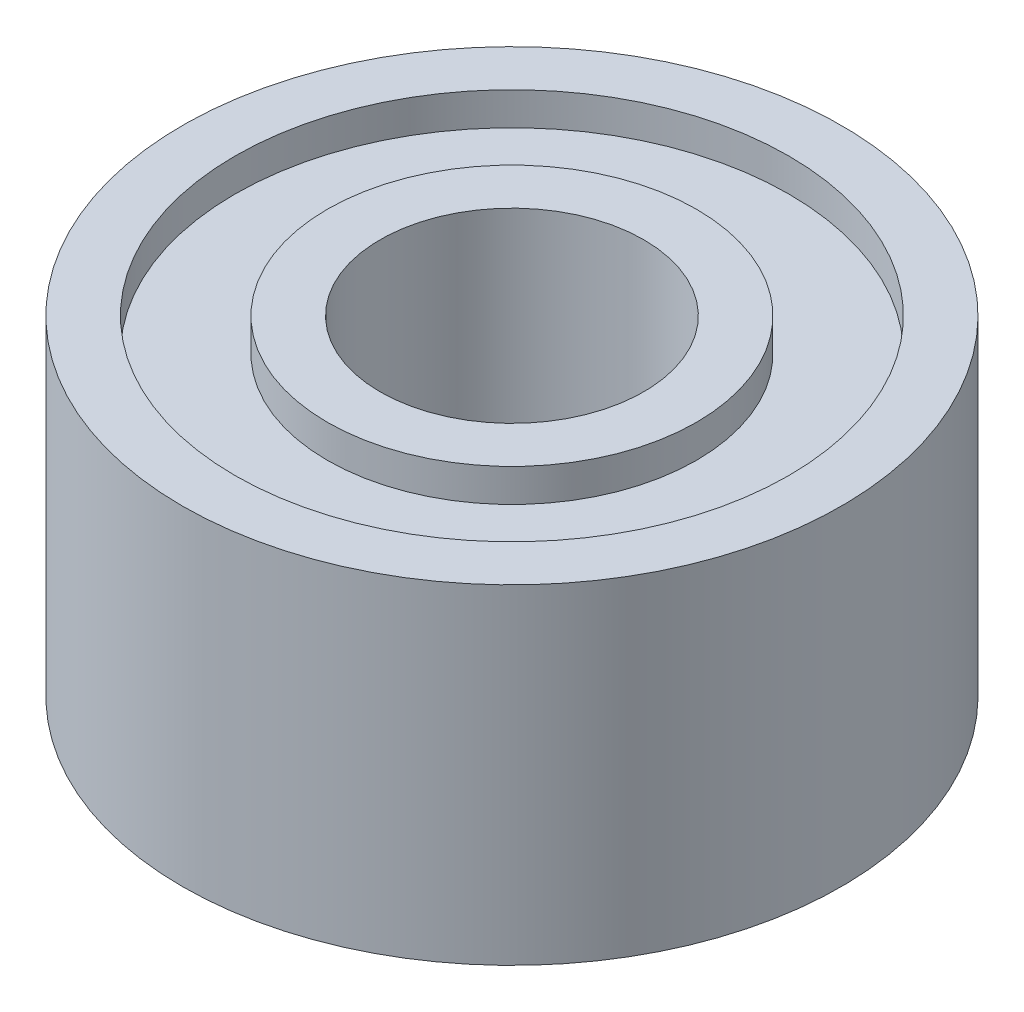
ISO-10303-21;
HEADER;
FILE_DESCRIPTION(('STEP AP214'),'2;1');
FILE_NAME('part.step','',(''),(''),'','','');
FILE_SCHEMA(('AUTOMOTIVE_DESIGN { 1 0 10303 214 1 1 1 1 }'));
ENDSEC;
DATA;
#1=APPLICATION_CONTEXT('core data for automotive mechanical design processes');
#2=APPLICATION_PROTOCOL_DEFINITION('international standard','automotive_design',2000,#1);
#3=PRODUCT_CONTEXT('',#1,'mechanical');
#4=PRODUCT('Part','Part','',(#3));
#5=PRODUCT_RELATED_PRODUCT_CATEGORY('part','',(#4));
#6=PRODUCT_DEFINITION_FORMATION('','',#4);
#7=PRODUCT_DEFINITION_CONTEXT('part definition',#1,'design');
#8=PRODUCT_DEFINITION('design','',#6,#7);
#9=PRODUCT_DEFINITION_SHAPE('','',#8);
#10=(LENGTH_UNIT() NAMED_UNIT(*) SI_UNIT(.MILLI.,.METRE.));
#11=(NAMED_UNIT(*) PLANE_ANGLE_UNIT() SI_UNIT($,.RADIAN.));
#12=(NAMED_UNIT(*) SI_UNIT($,.STERADIAN.) SOLID_ANGLE_UNIT());
#13=UNCERTAINTY_MEASURE_WITH_UNIT(LENGTH_MEASURE(1.E-05),#10,'distance_accuracy_value','');
#14=(GEOMETRIC_REPRESENTATION_CONTEXT(3) GLOBAL_UNCERTAINTY_ASSIGNED_CONTEXT((#13)) GLOBAL_UNIT_ASSIGNED_CONTEXT((#10,
#11,#12)) REPRESENTATION_CONTEXT('',''));
#15=CARTESIAN_POINT('',(0.,0.,0.));
#16=DIRECTION('',(0.,0.,1.));
#17=DIRECTION('',(1.,0.,0.));
#18=AXIS2_PLACEMENT_3D('',#15,#16,#17);
#19=CARTESIAN_POINT('',(0.,-1.25,0.));
#20=DIRECTION('',(0.,1.,0.));
#21=DIRECTION('',(0.,0.,1.));
#22=AXIS2_PLACEMENT_3D('',#19,#20,#21);
#23=PLANE('',#22);
#24=CARTESIAN_POINT('',(0.,-1.25,0.));
#25=DIRECTION('',(0.,1.,0.));
#26=DIRECTION('',(0.,0.,1.));
#27=AXIS2_PLACEMENT_3D('',#24,#25,#26);
#28=CIRCLE('',#27,1.);
#29=CARTESIAN_POINT('',(0.,-1.25,1.));
#30=VERTEX_POINT('',#29);
#31=EDGE_CURVE('E46',#30,#30,#28,.T.);
#32=ORIENTED_EDGE('',*,*,#31,.T.);
#33=EDGE_LOOP('',(#32));
#34=FACE_BOUND('',#33,.T.);
#35=CARTESIAN_POINT('',(0.,-1.25,0.));
#36=DIRECTION('',(0.,1.,0.));
#37=DIRECTION('',(0.,0.,1.));
#38=AXIS2_PLACEMENT_3D('',#35,#36,#37);
#39=CIRCLE('',#38,1.4);
#40=CARTESIAN_POINT('',(0.,-1.25,1.4));
#41=VERTEX_POINT('',#40);
#42=EDGE_CURVE('E70',#41,#41,#39,.T.);
#43=ORIENTED_EDGE('',*,*,#42,.F.);
#44=EDGE_LOOP('',(#43));
#45=FACE_BOUND('',#44,.T.);
#46=ADVANCED_FACE('F33',(#34,#45),#23,.F.);
#47=CARTESIAN_POINT('',(0.,1.25,0.));
#48=DIRECTION('',(0.,1.,0.));
#49=DIRECTION('',(0.,0.,1.));
#50=AXIS2_PLACEMENT_3D('',#47,#48,#49);
#51=PLANE('',#50);
#52=CARTESIAN_POINT('',(0.,1.25,0.));
#53=DIRECTION('',(0.,1.,0.));
#54=DIRECTION('',(0.,0.,1.));
#55=AXIS2_PLACEMENT_3D('',#52,#53,#54);
#56=CIRCLE('',#55,1.);
#57=CARTESIAN_POINT('',(0.,1.25,1.));
#58=VERTEX_POINT('',#57);
#59=EDGE_CURVE('E44',#58,#58,#56,.T.);
#60=ORIENTED_EDGE('',*,*,#59,.F.);
#61=EDGE_LOOP('',(#60));
#62=FACE_BOUND('',#61,.T.);
#63=CARTESIAN_POINT('',(0.,1.25,0.));
#64=DIRECTION('',(0.,1.,0.));
#65=DIRECTION('',(0.,0.,1.));
#66=AXIS2_PLACEMENT_3D('',#63,#64,#65);
#67=CIRCLE('',#66,1.4);
#68=CARTESIAN_POINT('',(0.,1.25,1.4));
#69=VERTEX_POINT('',#68);
#70=EDGE_CURVE('E58',#69,#69,#67,.T.);
#71=ORIENTED_EDGE('',*,*,#70,.T.);
#72=EDGE_LOOP('',(#71));
#73=FACE_BOUND('',#72,.T.);
#74=ADVANCED_FACE('F86',(#62,#73),#51,.T.);
#75=CARTESIAN_POINT('',(0.,1.25,0.));
#76=DIRECTION('',(0.,1.,0.));
#77=DIRECTION('',(0.,0.,1.));
#78=AXIS2_PLACEMENT_3D('',#75,#76,#77);
#79=CIRCLE('',#78,2.1);
#80=CARTESIAN_POINT('',(0.,1.25,2.1));
#81=VERTEX_POINT('',#80);
#82=EDGE_CURVE('E52',#81,#81,#79,.T.);
#83=ORIENTED_EDGE('',*,*,#82,.F.);
#84=EDGE_LOOP('',(#83));
#85=FACE_BOUND('',#84,.T.);
#86=CARTESIAN_POINT('',(0.,1.25,0.));
#87=DIRECTION('',(0.,1.,0.));
#88=DIRECTION('',(0.,0.,1.));
#89=AXIS2_PLACEMENT_3D('',#86,#87,#88);
#90=CIRCLE('',#89,2.5);
#91=CARTESIAN_POINT('',(0.,1.25,2.5));
#92=VERTEX_POINT('',#91);
#93=EDGE_CURVE('E10',#92,#92,#90,.T.);
#94=ORIENTED_EDGE('',*,*,#93,.T.);
#95=EDGE_LOOP('',(#94));
#96=FACE_BOUND('',#95,.T.);
#97=ADVANCED_FACE('F92',(#85,#96),#51,.T.);
#98=CARTESIAN_POINT('',(0.,-1.25,0.));
#99=DIRECTION('',(0.,1.,0.));
#100=DIRECTION('',(0.,0.,1.));
#101=AXIS2_PLACEMENT_3D('',#98,#99,#100);
#102=CIRCLE('',#101,2.1);
#103=CARTESIAN_POINT('',(0.,-1.25,2.1));
#104=VERTEX_POINT('',#103);
#105=EDGE_CURVE('E64',#104,#104,#102,.T.);
#106=ORIENTED_EDGE('',*,*,#105,.T.);
#107=EDGE_LOOP('',(#106));
#108=FACE_BOUND('',#107,.T.);
#109=CARTESIAN_POINT('',(0.,-1.25,0.));
#110=DIRECTION('',(0.,1.,0.));
#111=DIRECTION('',(0.,0.,1.));
#112=AXIS2_PLACEMENT_3D('',#109,#110,#111);
#113=CIRCLE('',#112,2.5);
#114=CARTESIAN_POINT('',(0.,-1.25,2.5));
#115=VERTEX_POINT('',#114);
#116=EDGE_CURVE('E37',#115,#115,#113,.T.);
#117=ORIENTED_EDGE('',*,*,#116,.F.);
#118=EDGE_LOOP('',(#117));
#119=FACE_BOUND('',#118,.T.);
#120=ADVANCED_FACE('F88',(#108,#119),#23,.F.);
#121=CARTESIAN_POINT('',(0.,1.25,0.));
#122=DIRECTION('',(0.,-1.,0.));
#123=DIRECTION('',(0.,0.,-1.));
#124=AXIS2_PLACEMENT_3D('',#121,#122,#123);
#125=CYLINDRICAL_SURFACE('',#124,2.5);
#126=ORIENTED_EDGE('',*,*,#93,.F.);
#127=EDGE_LOOP('',(#126));
#128=FACE_BOUND('',#127,.T.);
#129=ORIENTED_EDGE('',*,*,#116,.T.);
#130=EDGE_LOOP('',(#129));
#131=FACE_BOUND('',#130,.T.);
#132=ADVANCED_FACE('F35',(#128,#131),#125,.T.);
#133=CARTESIAN_POINT('',(0.,1.25,0.));
#134=DIRECTION('',(0.,-1.,0.));
#135=DIRECTION('',(0.,0.,-1.));
#136=AXIS2_PLACEMENT_3D('',#133,#134,#135);
#137=CYLINDRICAL_SURFACE('',#136,1.);
#138=ORIENTED_EDGE('',*,*,#59,.T.);
#139=EDGE_LOOP('',(#138));
#140=FACE_BOUND('',#139,.T.);
#141=ORIENTED_EDGE('',*,*,#31,.F.);
#142=EDGE_LOOP('',(#141));
#143=FACE_BOUND('',#142,.T.);
#144=ADVANCED_FACE('F101',(#140,#143),#137,.F.);
#145=CARTESIAN_POINT('',(0.,1.,0.));
#146=DIRECTION('',(0.,1.,0.));
#147=DIRECTION('',(0.,0.,1.));
#148=AXIS2_PLACEMENT_3D('',#145,#146,#147);
#149=CYLINDRICAL_SURFACE('',#148,2.1);
#150=CARTESIAN_POINT('',(0.,1.,0.));
#151=DIRECTION('',(0.,1.,0.));
#152=DIRECTION('',(0.,0.,1.));
#153=AXIS2_PLACEMENT_3D('',#150,#151,#152);
#154=CIRCLE('',#153,2.1);
#155=CARTESIAN_POINT('',(0.,1.,2.1));
#156=VERTEX_POINT('',#155);
#157=EDGE_CURVE('E49',#156,#156,#154,.T.);
#158=ORIENTED_EDGE('',*,*,#157,.F.);
#159=EDGE_LOOP('',(#158));
#160=FACE_BOUND('',#159,.T.);
#161=ORIENTED_EDGE('',*,*,#82,.T.);
#162=EDGE_LOOP('',(#161));
#163=FACE_BOUND('',#162,.T.);
#164=ADVANCED_FACE('F125',(#160,#163),#149,.F.);
#165=CARTESIAN_POINT('',(0.,1.,0.));
#166=DIRECTION('',(0.,1.,0.));
#167=DIRECTION('',(0.,0.,1.));
#168=AXIS2_PLACEMENT_3D('',#165,#166,#167);
#169=PLANE('',#168);
#170=CARTESIAN_POINT('',(0.,1.,0.));
#171=DIRECTION('',(0.,1.,0.));
#172=DIRECTION('',(0.,0.,1.));
#173=AXIS2_PLACEMENT_3D('',#170,#171,#172);
#174=CIRCLE('',#173,1.4);
#175=CARTESIAN_POINT('',(0.,1.,1.4));
#176=VERTEX_POINT('',#175);
#177=EDGE_CURVE('E55',#176,#176,#174,.T.);
#178=ORIENTED_EDGE('',*,*,#177,.F.);
#179=EDGE_LOOP('',(#178));
#180=FACE_BOUND('',#179,.T.);
#181=ORIENTED_EDGE('',*,*,#157,.T.);
#182=EDGE_LOOP('',(#181));
#183=FACE_BOUND('',#182,.T.);
#184=ADVANCED_FACE('F121',(#180,#183),#169,.T.);
#185=CARTESIAN_POINT('',(0.,1.,0.));
#186=DIRECTION('',(0.,1.,0.));
#187=DIRECTION('',(0.,0.,1.));
#188=AXIS2_PLACEMENT_3D('',#185,#186,#187);
#189=CYLINDRICAL_SURFACE('',#188,1.4);
#190=ORIENTED_EDGE('',*,*,#177,.T.);
#191=EDGE_LOOP('',(#190));
#192=FACE_BOUND('',#191,.T.);
#193=ORIENTED_EDGE('',*,*,#70,.F.);
#194=EDGE_LOOP('',(#193));
#195=FACE_BOUND('',#194,.T.);
#196=ADVANCED_FACE('F115',(#192,#195),#189,.T.);
#197=CARTESIAN_POINT('',(0.,-1.,0.));
#198=DIRECTION('',(0.,-1.,0.));
#199=DIRECTION('',(0.,0.,1.));
#200=AXIS2_PLACEMENT_3D('',#197,#198,#199);
#201=PLANE('',#200);
#202=CARTESIAN_POINT('',(0.,-1.,0.));
#203=DIRECTION('',(0.,1.,0.));
#204=DIRECTION('',(0.,0.,1.));
#205=AXIS2_PLACEMENT_3D('',#202,#203,#204);
#206=CIRCLE('',#205,2.1);
#207=CARTESIAN_POINT('',(0.,-1.,2.1));
#208=VERTEX_POINT('',#207);
#209=EDGE_CURVE('E61',#208,#208,#206,.T.);
#210=ORIENTED_EDGE('',*,*,#209,.F.);
#211=EDGE_LOOP('',(#210));
#212=FACE_BOUND('',#211,.T.);
#213=CARTESIAN_POINT('',(0.,-1.,0.));
#214=DIRECTION('',(0.,1.,0.));
#215=DIRECTION('',(0.,0.,1.));
#216=AXIS2_PLACEMENT_3D('',#213,#214,#215);
#217=CIRCLE('',#216,1.4);
#218=CARTESIAN_POINT('',(0.,-1.,1.4));
#219=VERTEX_POINT('',#218);
#220=EDGE_CURVE('E67',#219,#219,#217,.T.);
#221=ORIENTED_EDGE('',*,*,#220,.T.);
#222=EDGE_LOOP('',(#221));
#223=FACE_BOUND('',#222,.T.);
#224=ADVANCED_FACE('F76',(#212,#223),#201,.T.);
#225=CARTESIAN_POINT('',(0.,-1.,0.));
#226=DIRECTION('',(0.,-1.,0.));
#227=DIRECTION('',(0.,0.,-1.));
#228=AXIS2_PLACEMENT_3D('',#225,#226,#227);
#229=CYLINDRICAL_SURFACE('',#228,2.1);
#230=ORIENTED_EDGE('',*,*,#209,.T.);
#231=EDGE_LOOP('',(#230));
#232=FACE_BOUND('',#231,.T.);
#233=ORIENTED_EDGE('',*,*,#105,.F.);
#234=EDGE_LOOP('',(#233));
#235=FACE_BOUND('',#234,.T.);
#236=ADVANCED_FACE('F81',(#232,#235),#229,.F.);
#237=CARTESIAN_POINT('',(0.,-1.,0.));
#238=DIRECTION('',(0.,-1.,0.));
#239=DIRECTION('',(0.,0.,-1.));
#240=AXIS2_PLACEMENT_3D('',#237,#238,#239);
#241=CYLINDRICAL_SURFACE('',#240,1.4);
#242=ORIENTED_EDGE('',*,*,#220,.F.);
#243=EDGE_LOOP('',(#242));
#244=FACE_BOUND('',#243,.T.);
#245=ORIENTED_EDGE('',*,*,#42,.T.);
#246=EDGE_LOOP('',(#245));
#247=FACE_BOUND('',#246,.T.);
#248=ADVANCED_FACE('F78',(#244,#247),#241,.T.);
#249=CLOSED_SHELL('',(#46,#74,#97,#120,#132,#144,#164,#184,#196,#224,#236,#248));
#250=MANIFOLD_SOLID_BREP('B2',#249);
#251=ADVANCED_BREP_SHAPE_REPRESENTATION('',(#18,#250),#14);
#252=SHAPE_DEFINITION_REPRESENTATION(#9,#251);
ENDSEC;
END-ISO-10303-21;
